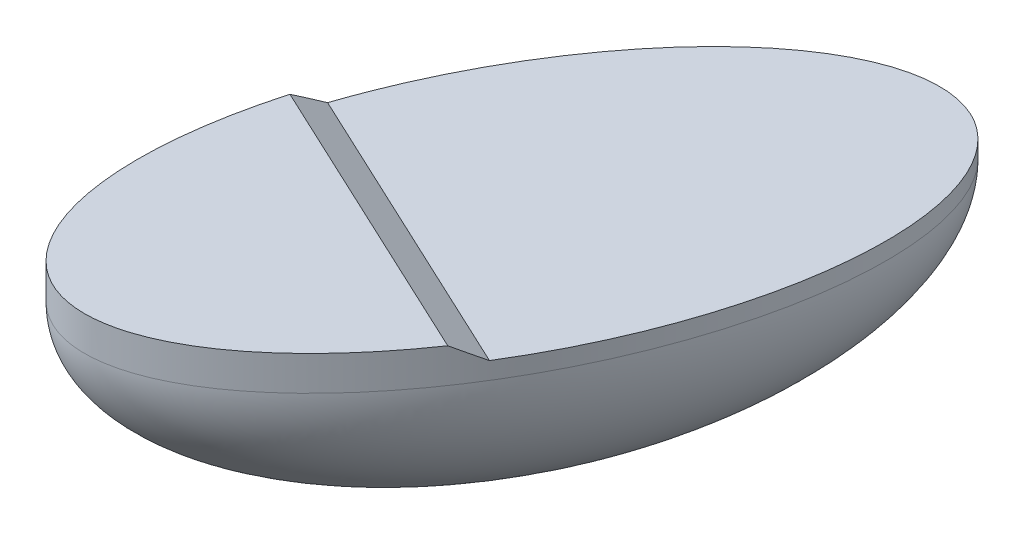
ISO-10303-21;
HEADER;
FILE_DESCRIPTION(('STEP AP214'),'2;1');
FILE_NAME('part.step','',(''),(''),'','','');
FILE_SCHEMA(('AUTOMOTIVE_DESIGN { 1 0 10303 214 1 1 1 1 }'));
ENDSEC;
DATA;
#1=APPLICATION_CONTEXT('core data for automotive mechanical design processes');
#2=APPLICATION_PROTOCOL_DEFINITION('international standard','automotive_design',2000,#1);
#3=PRODUCT_CONTEXT('',#1,'mechanical');
#4=PRODUCT('Part','Part','',(#3));
#5=PRODUCT_RELATED_PRODUCT_CATEGORY('part','',(#4));
#6=PRODUCT_DEFINITION_FORMATION('','',#4);
#7=PRODUCT_DEFINITION_CONTEXT('part definition',#1,'design');
#8=PRODUCT_DEFINITION('design','',#6,#7);
#9=PRODUCT_DEFINITION_SHAPE('','',#8);
#10=(LENGTH_UNIT() NAMED_UNIT(*) SI_UNIT(.MILLI.,.METRE.));
#11=(NAMED_UNIT(*) PLANE_ANGLE_UNIT() SI_UNIT($,.RADIAN.));
#12=(NAMED_UNIT(*) SI_UNIT($,.STERADIAN.) SOLID_ANGLE_UNIT());
#13=UNCERTAINTY_MEASURE_WITH_UNIT(LENGTH_MEASURE(1.E-05),#10,'distance_accuracy_value','');
#14=(GEOMETRIC_REPRESENTATION_CONTEXT(3) GLOBAL_UNCERTAINTY_ASSIGNED_CONTEXT((#13)) GLOBAL_UNIT_ASSIGNED_CONTEXT((#10,
#11,#12)) REPRESENTATION_CONTEXT('',''));
#15=CARTESIAN_POINT('',(0.,0.,0.));
#16=DIRECTION('',(0.,0.,1.));
#17=DIRECTION('',(1.,0.,0.));
#18=AXIS2_PLACEMENT_3D('',#15,#16,#17);
#19=CARTESIAN_POINT('',(0.,2000.,0.));
#20=DIRECTION('',(0.,1.,0.));
#21=DIRECTION('',(0.,0.,1.));
#22=AXIS2_PLACEMENT_3D('',#19,#20,#21);
#23=PLANE('',#22);
#24=CARTESIAN_POINT('',(0.,2000.,0.));
#25=DIRECTION('',(0.,1.,0.));
#26=DIRECTION('',(0.423940106048631,0.,-0.905690226558439));
#27=AXIS2_PLACEMENT_3D('',#24,#25,#26);
#28=ELLIPSE('',#27,40000.,20000.);
#29=CARTESIAN_POINT('',(13820.8411229119,2000.,16433.7412709297));
#30=VERTEX_POINT('',#29);
#31=CARTESIAN_POINT('',(-21472.6802396233,2000.,-86.6304306826926));
#32=VERTEX_POINT('',#31);
#33=EDGE_CURVE('E77',#30,#32,#28,.T.);
#34=ORIENTED_EDGE('',*,*,#33,.T.);
#35=DIRECTION('',(0.905690226558437,0.,0.423940106048634));
#36=VECTOR('',#35,1.);
#37=CARTESIAN_POINT('',(-3825.91955835571,2000.,8173.55542012348));
#38=LINE('',#37,#36);
#39=EDGE_CURVE('E84',#32,#30,#38,.T.);
#40=ORIENTED_EDGE('',*,*,#39,.T.);
#41=EDGE_LOOP('',(#34,#40));
#42=FACE_BOUND('',#41,.T.);
#43=ADVANCED_FACE('F41',(#42),#23,.T.);
#44=DIRECTION('',(0.,-1.,0.));
#45=VECTOR('',#44,1.);
#46=SURFACE_OF_LINEAR_EXTRUSION('',#28,#45);
#47=ORIENTED_EDGE('',*,*,#33,.F.);
#48=CARTESIAN_POINT('',(13820.8411229119,2000.,16433.7412709297));
#49=CARTESIAN_POINT('',(13769.8313260496,2055.69167472418,16516.3696457262));
#50=CARTESIAN_POINT('',(13718.6592328043,2111.373986921,16598.9041470144));
#51=CARTESIAN_POINT('',(13615.992632181,2222.71590833318,16763.7788149345));
#52=CARTESIAN_POINT('',(13564.4981438551,2278.37551868688,16846.1189926614));
#53=CARTESIAN_POINT('',(13461.1853985622,2389.67195168502,17010.6042173992));
#54=CARTESIAN_POINT('',(13409.367157001,2445.30877528154,17092.7492734422));
#55=CARTESIAN_POINT('',(13305.4054752259,2556.55954297689,17256.843409908));
#56=CARTESIAN_POINT('',(13253.2620467072,2612.17348782275,17338.7924972339));
#57=CARTESIAN_POINT('',(13148.6484983667,2723.37840284892,17502.4938155781));
#58=CARTESIAN_POINT('',(13096.1783864597,2778.9693735513,17584.2460512997));
#59=CARTESIAN_POINT('',(12990.9099108692,2890.12824064514,17747.5527454383));
#60=CARTESIAN_POINT('',(12938.1115512447,2945.69613731289,17829.1072062837));
#61=CARTESIAN_POINT('',(12832.1848393629,3056.80887003263,17992.0175619916));
#62=CARTESIAN_POINT('',(12779.0564865295,3112.35370604417,18073.3734565072));
#63=CARTESIAN_POINT('',(12672.4682172917,3223.42007339407,18235.8854774851));
#64=CARTESIAN_POINT('',(12619.0082970935,3278.94160445796,18317.0416016467));
#65=CARTESIAN_POINT('',(12511.7551436792,3389.96122786285,18479.1530066685));
#66=CARTESIAN_POINT('',(12457.9619026809,3445.45931962405,18560.1082827772));
#67=CARTESIAN_POINT('',(12350.0402853249,3556.43192454726,18721.8168711816));
#68=CARTESIAN_POINT('',(12295.9118971044,3611.90643679953,18802.5701761847));
#69=CARTESIAN_POINT('',(12187.3180926631,3722.83173841062,18963.8736605111));
#70=CARTESIAN_POINT('',(12132.8526604,3778.28252650384,19044.4238299049));
#71=CARTESIAN_POINT('',(12023.5827869244,3889.16022519801,19205.3198201036));
#72=CARTESIAN_POINT('',(11968.7783253839,3944.58713414983,19285.6656282396));
#73=CARTESIAN_POINT('',(11913.8053703734,4000.,19365.9057109273));
#74=B_SPLINE_CURVE_WITH_KNOTS('',3,(#48,#49,#50,#51,#52,#53,#54,#55,#56,#57,#58,#59,#60,#61,#62,
#63,#64,#65,#66,#67,#68,#69,#70,#71,#72,#73),.UNSPECIFIED.,.F.,.F.,(4,2,2,2,2,2,2,2,2,2,2,2,4),
(0.,335.825837614167,671.63201333477,1007.42232952218,1343.20063786331,1678.97084254081,
2014.73690351186,2350.50355083537,2686.27404720107,3022.05241266846,3357.84273212364,
3693.64915907925,4029.47591962745),.UNSPECIFIED.);
#75=CARTESIAN_POINT('',(11913.8053703734,4000.,19365.9057109273));
#76=VERTEX_POINT('',#75);
#77=EDGE_CURVE('E51',#30,#76,#74,.T.);
#78=ORIENTED_EDGE('',*,*,#77,.T.);
#79=CARTESIAN_POINT('',(0.,4000.,0.));
#80=DIRECTION('',(0.,1.,0.));
#81=DIRECTION('',(0.423940106048631,0.,-0.905690226558439));
#82=AXIS2_PLACEMENT_3D('',#79,#80,#81);
#83=ELLIPSE('',#82,40000.,20000.);
#84=CARTESIAN_POINT('',(-22502.7876992543,4000.,3256.0110825908));
#85=VERTEX_POINT('',#84);
#86=EDGE_CURVE('E78',#85,#76,#83,.T.);
#87=ORIENTED_EDGE('',*,*,#86,.F.);
#88=CARTESIAN_POINT('',(-22502.7876992542,4000.,3256.0110825908));
#89=CARTESIAN_POINT('',(-22476.3828928654,3944.58713414983,3162.3986750163));
#90=CARTESIAN_POINT('',(-22449.7889697062,3889.16022519801,3068.84793402109));
#91=CARTESIAN_POINT('',(-22396.2270031316,3778.28252650384,2881.87590229422));
#92=CARTESIAN_POINT('',(-22369.2589824659,3722.83173841063,2788.4546040676));
#93=CARTESIAN_POINT('',(-22314.9510385647,3611.90643679953,2601.74071693516));
#94=CARTESIAN_POINT('',(-22287.6111332302,3556.43192454726,2508.44812207054));
#95=CARTESIAN_POINT('',(-22232.5615339427,3445.45931962405,2321.99092946388));
#96=CARTESIAN_POINT('',(-22204.8518531886,3389.96122786285,2228.82632728342));
#97=CARTESIAN_POINT('',(-22149.0647399523,3278.94160445796,2042.62443536976));
#98=CARTESIAN_POINT('',(-22120.9873161037,3223.42007339406,1949.58714270411));
#99=CARTESIAN_POINT('',(-22064.4666718604,3112.35370604418,1763.63921215435));
#100=CARTESIAN_POINT('',(-22036.0234556627,3056.80887003263,1670.72857283058));
#101=CARTESIAN_POINT('',(-21978.7731631978,2945.6961373129,1485.03351016152));
#102=CARTESIAN_POINT('',(-21949.9660875662,2890.12824064515,1392.24908659608));
#103=CARTESIAN_POINT('',(-21891.9898071781,2778.96937355131,1206.80562023506));
#104=CARTESIAN_POINT('',(-21862.8205979569,2723.37840284892,1114.14657900094));
#105=CARTESIAN_POINT('',(-21804.1217656329,2612.17348782275,928.953265925592));
#106=CARTESIAN_POINT('',(-21774.5921338486,2556.55954297689,836.418997149599));
#107=CARTESIAN_POINT('',(-21715.1740970312,2445.30877528154,651.47464389501));
#108=CARTESIAN_POINT('',(-21685.2856792058,2389.67195168503,559.064563975736));
#109=CARTESIAN_POINT('',(-21625.1516431392,2278.37551868688,374.368028536274));
#110=CARTESIAN_POINT('',(-21594.9060080938,2222.71590833318,282.081579061065));
#111=CARTESIAN_POINT('',(-21534.0590243643,2111.373986921,97.6317713183087));
#112=CARTESIAN_POINT('',(-21503.4576549563,2055.69167472418,5.46842057429456));
#113=CARTESIAN_POINT('',(-21472.6802396233,2000.,-86.6304306826983));
#114=B_SPLINE_CURVE_WITH_KNOTS('',3,(#88,#89,#90,#91,#92,#93,#94,#95,#96,#97,#98,#99,#100,#101,
#102,#103,#104,#105,#106,#107,#108,#109,#110,#111,#112,#113),.UNSPECIFIED.,.F.,.F.,(4,2,2,2,2,2,
2,2,2,2,2,2,4),(0.,335.826760548197,671.63318750381,1007.42350695899,1343.20187242638,
1678.97236879208,2014.73901611558,2350.50507708664,2686.27528176414,3022.05359010527,
3357.84390629268,3693.65008201328,4029.47591962745),.UNSPECIFIED.);
#115=EDGE_CURVE('E73',#85,#32,#114,.T.);
#116=ORIENTED_EDGE('',*,*,#115,.T.);
#117=EDGE_LOOP('',(#47,#78,#87,#116));
#118=FACE_BOUND('',#117,.T.);
#119=CARTESIAN_POINT('',(0.,0.,0.));
#120=DIRECTION('',(0.,1.,0.));
#121=DIRECTION('',(0.423940106048631,0.,-0.905690226558439));
#122=AXIS2_PLACEMENT_3D('',#119,#120,#121);
#123=ELLIPSE('',#122,40000.,20000.);
#124=CARTESIAN_POINT('',(16957.6042419452,0.,-36227.6090623375));
#125=VERTEX_POINT('',#124);
#126=CARTESIAN_POINT('',(-16957.6042419452,0.,36227.6090623375));
#127=VERTEX_POINT('',#126);
#128=EDGE_CURVE('E85',#125,#127,#123,.T.);
#129=ORIENTED_EDGE('',*,*,#128,.T.);
#130=CARTESIAN_POINT('',(0.,0.,0.));
#131=DIRECTION('',(0.,-1.,0.));
#132=DIRECTION('',(0.423940106048631,0.,-0.905690226558439));
#133=AXIS2_PLACEMENT_3D('',#130,#131,#132);
#134=ELLIPSE('',#133,40000.,20000.);
#135=EDGE_CURVE('E88',#125,#127,#134,.T.);
#136=ORIENTED_EDGE('',*,*,#135,.F.);
#137=EDGE_LOOP('',(#129,#136));
#138=FACE_BOUND('',#137,.T.);
#139=ADVANCED_FACE('F75',(#118,#138),#46,.F.);
#140=CARTESIAN_POINT('',(2.1316282072803E-11,0.,-2.8421709430404E-11));
#141=DIRECTION('',(0.,1.,0.));
#142=DIRECTION('',(0.423940106048631,0.,-0.905690226558439));
#143=AXIS2_PLACEMENT_3D('',#140,#141,#142);
#144=ELLIPSE('',#143,40000.,20000.);
#145=TRIMMED_CURVE('',#144,(PARAMETER_VALUE(0.)),(PARAMETER_VALUE(3.14159265358979)),.T.,.PARAMETER.);
#146=CARTESIAN_POINT('',(-16957.6042419452,0.,36227.6090623375));
#147=DIRECTION('',(-0.423940106048631,0.,0.905690226558439));
#148=AXIS1_PLACEMENT('',#146,#147);
#149=SURFACE_OF_REVOLUTION('',#145,#148);
#150=ORIENTED_EDGE('',*,*,#135,.T.);
#151=ORIENTED_EDGE('',*,*,#128,.F.);
#152=EDGE_LOOP('',(#150,#151));
#153=FACE_BOUND('',#152,.T.);
#154=ADVANCED_FACE('F96',(#153),#149,.T.);
#155=CARTESIAN_POINT('',(0.,4000.,0.));
#156=DIRECTION('',(0.,1.,0.));
#157=DIRECTION('',(0.,0.,1.));
#158=AXIS2_PLACEMENT_3D('',#155,#156,#157);
#159=PLANE('',#158);
#160=ORIENTED_EDGE('',*,*,#86,.T.);
#161=DIRECTION('',(-0.905690226558437,0.,-0.423940106048634));
#162=VECTOR('',#161,1.);
#163=CARTESIAN_POINT('',(-5294.49116444045,4000.,11310.958396759));
#164=LINE('',#163,#162);
#165=EDGE_CURVE('E11',#76,#85,#164,.T.);
#166=ORIENTED_EDGE('',*,*,#165,.T.);
#167=EDGE_LOOP('',(#160,#166));
#168=FACE_BOUND('',#167,.T.);
#169=ADVANCED_FACE('F100',(#168),#159,.T.);
#170=CARTESIAN_POINT('',(-3825.91955835571,2000.,8173.55542012348));
#171=DIRECTION('',(-0.211970053024317,-0.866025403784439,0.452845113279219));
#172=DIRECTION('',(0.905690226558437,0.,0.423940106048634));
#173=AXIS2_PLACEMENT_3D('',#170,#171,#172);
#174=PLANE('',#173);
#175=ORIENTED_EDGE('',*,*,#115,.F.);
#176=ORIENTED_EDGE('',*,*,#165,.F.);
#177=ORIENTED_EDGE('',*,*,#77,.F.);
#178=ORIENTED_EDGE('',*,*,#39,.F.);
#179=EDGE_LOOP('',(#175,#176,#177,#178));
#180=FACE_BOUND('',#179,.T.);
#181=ADVANCED_FACE('F44',(#180),#174,.F.);
#182=CLOSED_SHELL('',(#43,#139,#154,#169,#181));
#183=MANIFOLD_SOLID_BREP('B2',#182);
#184=ADVANCED_BREP_SHAPE_REPRESENTATION('',(#18,#183),#14);
#185=SHAPE_DEFINITION_REPRESENTATION(#9,#184);
ENDSEC;
END-ISO-10303-21;
